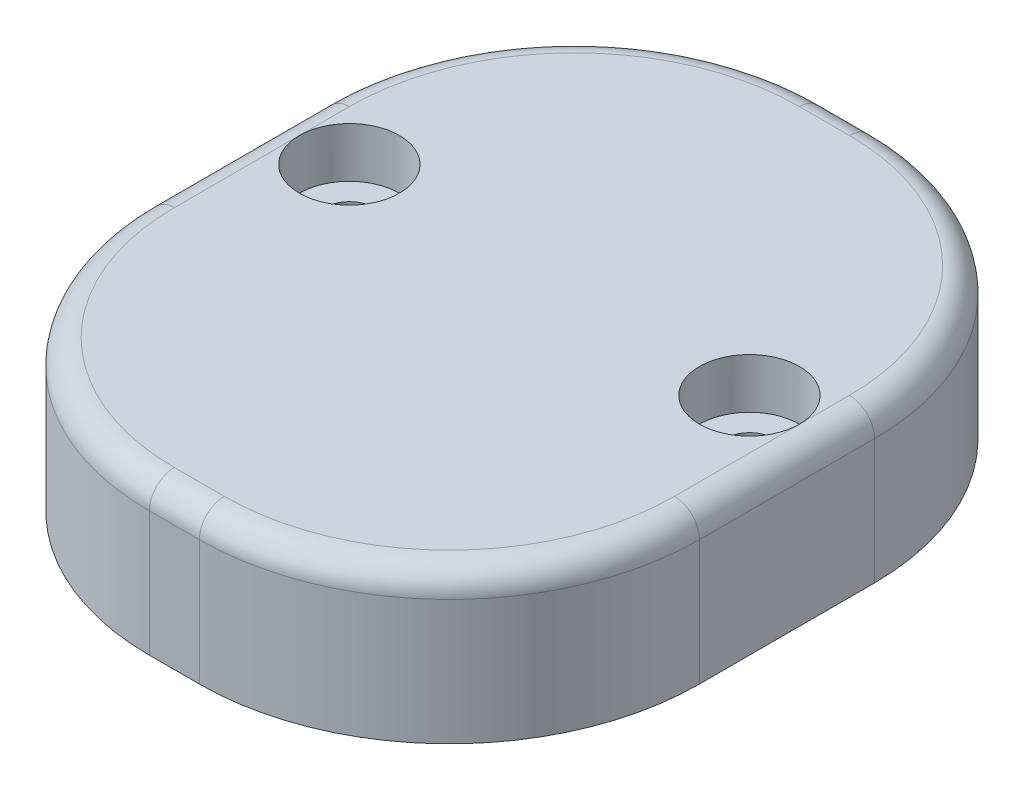
ISO-10303-21;
HEADER;
FILE_DESCRIPTION(('STEP AP214'),'2;1');
FILE_NAME('part.step','',(''),(''),'','','');
FILE_SCHEMA(('AUTOMOTIVE_DESIGN { 1 0 10303 214 1 1 1 1 }'));
ENDSEC;
DATA;
#1=APPLICATION_CONTEXT('core data for automotive mechanical design processes');
#2=APPLICATION_PROTOCOL_DEFINITION('international standard','automotive_design',2000,#1);
#3=PRODUCT_CONTEXT('',#1,'mechanical');
#4=PRODUCT('Part','Part','',(#3));
#5=PRODUCT_RELATED_PRODUCT_CATEGORY('part','',(#4));
#6=PRODUCT_DEFINITION_FORMATION('','',#4);
#7=PRODUCT_DEFINITION_CONTEXT('part definition',#1,'design');
#8=PRODUCT_DEFINITION('design','',#6,#7);
#9=PRODUCT_DEFINITION_SHAPE('','',#8);
#10=(LENGTH_UNIT() NAMED_UNIT(*) SI_UNIT(.MILLI.,.METRE.));
#11=(NAMED_UNIT(*) PLANE_ANGLE_UNIT() SI_UNIT($,.RADIAN.));
#12=(NAMED_UNIT(*) SI_UNIT($,.STERADIAN.) SOLID_ANGLE_UNIT());
#13=UNCERTAINTY_MEASURE_WITH_UNIT(LENGTH_MEASURE(1.E-05),#10,'distance_accuracy_value','');
#14=(GEOMETRIC_REPRESENTATION_CONTEXT(3) GLOBAL_UNCERTAINTY_ASSIGNED_CONTEXT((#13)) GLOBAL_UNIT_ASSIGNED_CONTEXT((#10,
#11,#12)) REPRESENTATION_CONTEXT('',''));
#15=CARTESIAN_POINT('',(0.,0.,0.));
#16=DIRECTION('',(0.,0.,1.));
#17=DIRECTION('',(1.,0.,0.));
#18=AXIS2_PLACEMENT_3D('',#15,#16,#17);
#19=CARTESIAN_POINT('',(0.,0.,0.));
#20=DIRECTION('',(0.,0.,1.));
#21=DIRECTION('',(1.,0.,0.));
#22=AXIS2_PLACEMENT_3D('',#19,#20,#21);
#23=PLANE('',#22);
#24=DIRECTION('',(0.,1.,0.));
#25=VECTOR('',#24,1.);
#26=CARTESIAN_POINT('',(10.,6.,0.));
#27=LINE('',#26,#25);
#28=CARTESIAN_POINT('',(10.,4.89897948556636,0.));
#29=VERTEX_POINT('',#28);
#30=CARTESIAN_POINT('',(10.,5.,0.));
#31=VERTEX_POINT('',#30);
#32=EDGE_CURVE('E187',#29,#31,#27,.T.);
#33=ORIENTED_EDGE('',*,*,#32,.T.);
#34=DIRECTION('',(1.,0.,0.));
#35=VECTOR('',#34,1.);
#36=CARTESIAN_POINT('',(12.,5.,0.));
#37=LINE('',#36,#35);
#38=CARTESIAN_POINT('',(11.,5.,0.));
#39=VERTEX_POINT('',#38);
#40=EDGE_CURVE('E267',#31,#39,#37,.T.);
#41=ORIENTED_EDGE('',*,*,#40,.T.);
#42=CARTESIAN_POINT('',(11.,0.,0.));
#43=DIRECTION('',(0.,0.,1.));
#44=DIRECTION('',(1.,0.,0.));
#45=AXIS2_PLACEMENT_3D('',#42,#43,#44);
#46=CIRCLE('',#45,5.);
#47=EDGE_CURVE('E164',#29,#39,#46,.F.);
#48=ORIENTED_EDGE('',*,*,#47,.F.);
#49=EDGE_LOOP('',(#33,#41,#48));
#50=FACE_BOUND('',#49,.T.);
#51=ADVANCED_FACE('F35',(#50),#23,.F.);
#52=CARTESIAN_POINT('',(11.,0.,22.));
#53=DIRECTION('',(0.,0.,-1.));
#54=DIRECTION('',(-1.,0.,0.));
#55=AXIS2_PLACEMENT_3D('',#52,#53,#54);
#56=CYLINDRICAL_SURFACE('',#55,5.);
#57=DIRECTION('',(0.,0.,-1.));
#58=VECTOR('',#57,1.);
#59=CARTESIAN_POINT('',(6.,0.,22.));
#60=LINE('',#59,#58);
#61=CARTESIAN_POINT('',(6.,0.,22.));
#62=VERTEX_POINT('',#61);
#63=CARTESIAN_POINT('',(6.,0.,0.834848610088321));
#64=VERTEX_POINT('',#63);
#65=EDGE_CURVE('E156',#62,#64,#60,.T.);
#66=ORIENTED_EDGE('',*,*,#65,.T.);
#67=CARTESIAN_POINT('',(6.,0.,0.834848610088321));
#68=CARTESIAN_POINT('',(5.99997867187738,0.135011845033446,0.834882018948806));
#69=CARTESIAN_POINT('',(6.00546746244243,0.270010557183533,0.832463030257463));
#70=CARTESIAN_POINT('',(6.0273036116272,0.538906984847514,0.82296657021474));
#71=CARTESIAN_POINT('',(6.04364641369319,0.672805138510441,0.815891053702076));
#72=CARTESIAN_POINT('',(6.08694176524044,0.93800536106932,0.79736486598689));
#73=CARTESIAN_POINT('',(6.11385130062064,1.06931571634541,0.785931938020787));
#74=CARTESIAN_POINT('',(6.17799889048549,1.32898103097825,0.759138461814082));
#75=CARTESIAN_POINT('',(6.21523768152985,1.45733577886905,0.743777633488427));
#76=CARTESIAN_POINT('',(6.2996412162674,1.71007289707297,0.709714282724713));
#77=CARTESIAN_POINT('',(6.34679151482346,1.83446074821384,0.691016629336118));
#78=CARTESIAN_POINT('',(6.45066344419621,2.07874315416516,0.650919566211288));
#79=CARTESIAN_POINT('',(6.50738867032313,2.19863600039304,0.629519142368764));
#80=CARTESIAN_POINT('',(6.69138039763596,2.55065991663144,0.562302920265389));
#81=CARTESIAN_POINT('',(6.83246766867098,2.77515039770592,0.513470148602644));
#82=CARTESIAN_POINT('',(7.1564694231924,3.21008706511323,0.411226797712404));
#83=CARTESIAN_POINT('',(7.34120934875028,3.41915137620118,0.357710877119809));
#84=CARTESIAN_POINT('',(7.64283316769946,3.70794894262942,0.281225043641196));
#85=CARTESIAN_POINT('',(7.74755685338337,3.80014759496294,0.256342104162777));
#86=CARTESIAN_POINT('',(7.96462514598613,3.97567035613554,0.208699057654279));
#87=CARTESIAN_POINT('',(8.07696676447299,4.05899791241655,0.185938126410237));
#88=CARTESIAN_POINT('',(8.31112881266445,4.21786973870763,0.142911601921965));
#89=CARTESIAN_POINT('',(8.43310154925899,4.29320706490404,0.122710511282571));
#90=CARTESIAN_POINT('',(8.68347126805493,4.43331222756631,0.0862347494353322));
#91=CARTESIAN_POINT('',(8.81186521516233,4.49808499699451,0.0699582439928226));
#92=CARTESIAN_POINT('',(9.07387178505899,4.61634532323629,0.0421084282489397));
#93=CARTESIAN_POINT('',(9.20747142306811,4.66985906491516,0.0305241459201425));
#94=CARTESIAN_POINT('',(9.47903775417308,4.76522326674506,0.0126539151737671));
#95=CARTESIAN_POINT('',(9.61700084044304,4.80708309321236,0.0063637036076295));
#96=CARTESIAN_POINT('',(9.79687154728861,4.85326917813204,0.00198147055236757));
#97=CARTESIAN_POINT('',(9.83735341458672,4.86312562393378,0.00124020583946215));
#98=CARTESIAN_POINT('',(9.91852063678993,4.88181658890864,0.000249786474286768));
#99=CARTESIAN_POINT('',(9.95920577997313,4.89065200450769,1.97011901891483E-07));
#100=CARTESIAN_POINT('',(10.,4.89897948556636,0.));
#101=B_SPLINE_CURVE_WITH_KNOTS('',3,(#67,#68,#69,#70,#71,#72,#73,#74,#75,#76,#77,#78,#79,#80,
#81,#82,#83,#84,#85,#86,#87,#88,#89,#90,#91,#92,#93,#94,#95,#96,#97,#98,#99,#100),.UNSPECIFIED.,
.F.,.F.,(4,2,2,2,2,2,2,2,2,2,2,2,2,2,2,2,4),(0.,0.404881690591231,0.809593517715284,
1.21267468031032,1.6157845932544,2.01831103288909,2.42098895565289,3.22630049164659,
4.07444094444146,4.49921419060271,4.92382175621481,5.35759888778723,5.79117289011644,
6.22372711209933,6.65593267760133,6.78093528552342,6.90582729841),.UNSPECIFIED.);
#102=EDGE_CURVE('E209',#64,#29,#101,.T.);
#103=ORIENTED_EDGE('',*,*,#102,.T.);
#104=ORIENTED_EDGE('',*,*,#47,.T.);
#105=CARTESIAN_POINT('',(12.,4.89897948556636,0.));
#106=VERTEX_POINT('',#105);
#107=EDGE_CURVE('E172',#39,#106,#46,.F.);
#108=ORIENTED_EDGE('',*,*,#107,.T.);
#109=CARTESIAN_POINT('',(12.,4.89897948556636,0.));
#110=CARTESIAN_POINT('',(12.1322032583834,4.87201440791222,-2.14329301021152E-05));
#111=CARTESIAN_POINT('',(12.2632817786647,4.83966390255237,0.0026210772666264));
#112=CARTESIAN_POINT('',(12.5221637065431,4.76456920101274,0.012807986322809));
#113=CARTESIAN_POINT('',(12.6499687294982,4.72183024482699,0.0203499170843514));
#114=CARTESIAN_POINT('',(12.9009022287471,4.62650199462219,0.039870763241075));
#115=CARTESIAN_POINT('',(13.0240475964267,4.57395342911886,0.0518315261982716));
#116=CARTESIAN_POINT('',(13.265360329098,4.45937262791172,0.0796352779055718));
#117=CARTESIAN_POINT('',(13.3835272001646,4.39733945403671,0.0954786507980635));
#118=CARTESIAN_POINT('',(13.7290562348091,4.19794694565129,0.147872954381521));
#119=CARTESIAN_POINT('',(13.9480606298654,4.04705970582392,0.189340943626381));
#120=CARTESIAN_POINT('',(14.3586104835474,3.71347505726727,0.279847902943476));
#121=CARTESIAN_POINT('',(14.550127808398,3.53074547451764,0.328894524855925));
#122=CARTESIAN_POINT('',(14.9118890352833,3.12647082880639,0.431394504019483));
#123=CARTESIAN_POINT('',(15.0803032775626,2.90330913059372,0.484939834020765));
#124=CARTESIAN_POINT('',(15.3782195431659,2.43086293163413,0.586576785252228));
#125=CARTESIAN_POINT('',(15.5077030843076,2.1815660988498,0.634665809400884));
#126=CARTESIAN_POINT('',(15.6705504775165,1.79065148045435,0.697823053148833));
#127=CARTESIAN_POINT('',(15.719898856655,1.65623845449805,0.717513784014776));
#128=CARTESIAN_POINT('',(15.8069961070902,1.38321419059191,0.752892259267276));
#129=CARTESIAN_POINT('',(15.8447503790763,1.24460494045593,0.768581866851002));
#130=CARTESIAN_POINT('',(15.908180059381,0.964546007225919,0.795256124157805));
#131=CARTESIAN_POINT('',(15.9338823337092,0.823103381836048,0.806251233791758));
#132=CARTESIAN_POINT('',(15.9730136005027,0.538297729866727,0.823092907288587));
#133=CARTESIAN_POINT('',(15.9864520818861,0.394936275251337,0.828943451550562));
#134=CARTESIAN_POINT('',(15.9957891902516,0.209406770232198,0.833011982947895));
#135=CARTESIAN_POINT('',(15.9973688350891,0.167521864295987,0.833700727781765));
#136=CARTESIAN_POINT('',(15.9994735454067,0.0837597007614819,0.834618717628923));
#137=CARTESIAN_POINT('',(15.9999995950335,0.0418824725949628,0.834848391452833));
#138=CARTESIAN_POINT('',(16.,0.,0.834848610088265));
#139=B_SPLINE_CURVE_WITH_KNOTS('',3,(#109,#110,#111,#112,#113,#114,#115,#116,#117,#118,#119,
#120,#121,#122,#123,#124,#125,#126,#127,#128,#129,#130,#131,#132,#133,#134,#135,#136,#137,#138),
.UNSPECIFIED.,.F.,.F.,(4,2,2,2,2,2,2,2,2,2,2,2,2,2,4),(0.,0.404599235286033,0.80899481037096,
1.21174728420965,1.61453962216218,2.41817085710597,3.22261885287953,4.07282394175045,
4.92343202678592,5.35655012939949,5.78946617273127,6.22141252807982,6.65302438762456,
6.7787749103284,6.90440791655807),.UNSPECIFIED.);
#140=CARTESIAN_POINT('',(16.,0.,0.834848610088321));
#141=VERTEX_POINT('',#140);
#142=EDGE_CURVE('E152',#106,#141,#139,.T.);
#143=ORIENTED_EDGE('',*,*,#142,.T.);
#144=DIRECTION('',(0.,0.,-1.));
#145=VECTOR('',#144,1.);
#146=CARTESIAN_POINT('',(16.,0.,22.));
#147=LINE('',#146,#145);
#148=CARTESIAN_POINT('',(16.,0.,22.));
#149=VERTEX_POINT('',#148);
#150=EDGE_CURVE('E145',#149,#141,#147,.T.);
#151=ORIENTED_EDGE('',*,*,#150,.F.);
#152=CARTESIAN_POINT('',(11.,0.,22.));
#153=DIRECTION('',(0.,0.,1.));
#154=DIRECTION('',(1.,0.,0.));
#155=AXIS2_PLACEMENT_3D('',#152,#153,#154);
#156=CIRCLE('',#155,5.);
#157=EDGE_CURVE('E149',#62,#149,#156,.F.);
#158=ORIENTED_EDGE('',*,*,#157,.F.);
#159=EDGE_LOOP('',(#66,#103,#104,#108,#143,#151,#158));
#160=FACE_BOUND('',#159,.T.);
#161=ADVANCED_FACE('F148',(#160),#56,.F.);
#162=CARTESIAN_POINT('',(0.,0.,22.));
#163=DIRECTION('',(0.,1.,0.));
#164=DIRECTION('',(0.,0.,1.));
#165=AXIS2_PLACEMENT_3D('',#162,#163,#164);
#166=PLANE('',#165);
#167=CARTESIAN_POINT('',(19.,0.,12.));
#168=DIRECTION('',(0.,1.,0.));
#169=DIRECTION('',(0.,0.,1.));
#170=AXIS2_PLACEMENT_3D('',#167,#168,#169);
#171=CIRCLE('',#170,0.999999999999997);
#172=CARTESIAN_POINT('',(19.,0.,13.));
#173=VERTEX_POINT('',#172);
#174=EDGE_CURVE('E322',#173,#173,#171,.T.);
#175=ORIENTED_EDGE('',*,*,#174,.T.);
#176=EDGE_LOOP('',(#175));
#177=FACE_BOUND('',#176,.T.);
#178=CARTESIAN_POINT('',(3.,0.,12.));
#179=DIRECTION('',(0.,1.,0.));
#180=DIRECTION('',(0.,0.,1.));
#181=AXIS2_PLACEMENT_3D('',#178,#179,#180);
#182=CIRCLE('',#181,0.999999999999998);
#183=CARTESIAN_POINT('',(3.,0.,13.));
#184=VERTEX_POINT('',#183);
#185=EDGE_CURVE('E169',#184,#184,#182,.T.);
#186=ORIENTED_EDGE('',*,*,#185,.T.);
#187=EDGE_LOOP('',(#186));
#188=FACE_BOUND('',#187,.T.);
#189=DIRECTION('',(0.,0.,-1.));
#190=VECTOR('',#189,1.);
#191=CARTESIAN_POINT('',(0.,0.,22.));
#192=LINE('',#191,#190);
#193=CARTESIAN_POINT('',(0.,0.,17.));
#194=VERTEX_POINT('',#193);
#195=CARTESIAN_POINT('',(0.,0.,10.));
#196=VERTEX_POINT('',#195);
#197=EDGE_CURVE('E163',#194,#196,#192,.T.);
#198=ORIENTED_EDGE('',*,*,#197,.T.);
#199=CARTESIAN_POINT('',(10.,0.,10.));
#200=DIRECTION('',(0.,1.,0.));
#201=DIRECTION('',(0.,0.,1.));
#202=AXIS2_PLACEMENT_3D('',#199,#200,#201);
#203=CIRCLE('',#202,10.);
#204=EDGE_CURVE('E201',#196,#64,#203,.F.);
#205=ORIENTED_EDGE('',*,*,#204,.T.);
#206=ORIENTED_EDGE('',*,*,#65,.F.);
#207=DIRECTION('',(1.,0.,0.));
#208=VECTOR('',#207,1.);
#209=CARTESIAN_POINT('',(0.,0.,22.));
#210=LINE('',#209,#208);
#211=EDGE_CURVE('E162',#62,#149,#210,.T.);
#212=ORIENTED_EDGE('',*,*,#211,.T.);
#213=ORIENTED_EDGE('',*,*,#150,.T.);
#214=CARTESIAN_POINT('',(12.,0.,10.));
#215=DIRECTION('',(0.,1.,0.));
#216=DIRECTION('',(0.,0.,1.));
#217=AXIS2_PLACEMENT_3D('',#214,#215,#216);
#218=CIRCLE('',#217,10.);
#219=CARTESIAN_POINT('',(22.,0.,10.));
#220=VERTEX_POINT('',#219);
#221=EDGE_CURVE('E197',#141,#220,#218,.F.);
#222=ORIENTED_EDGE('',*,*,#221,.T.);
#223=DIRECTION('',(0.,0.,-1.));
#224=VECTOR('',#223,1.);
#225=CARTESIAN_POINT('',(22.,0.,22.));
#226=LINE('',#225,#224);
#227=CARTESIAN_POINT('',(22.,0.,17.));
#228=VERTEX_POINT('',#227);
#229=EDGE_CURVE('E157',#228,#220,#226,.T.);
#230=ORIENTED_EDGE('',*,*,#229,.F.);
#231=CARTESIAN_POINT('',(12.,0.,17.));
#232=DIRECTION('',(0.,1.,0.));
#233=DIRECTION('',(0.,0.,1.));
#234=AXIS2_PLACEMENT_3D('',#231,#232,#233);
#235=CIRCLE('',#234,10.);
#236=CARTESIAN_POINT('',(12.,0.,27.));
#237=VERTEX_POINT('',#236);
#238=EDGE_CURVE('E195',#228,#237,#235,.F.);
#239=ORIENTED_EDGE('',*,*,#238,.T.);
#240=DIRECTION('',(1.,0.,0.));
#241=VECTOR('',#240,1.);
#242=CARTESIAN_POINT('',(0.,0.,27.));
#243=LINE('',#242,#241);
#244=CARTESIAN_POINT('',(10.,0.,27.));
#245=VERTEX_POINT('',#244);
#246=EDGE_CURVE('E168',#245,#237,#243,.T.);
#247=ORIENTED_EDGE('',*,*,#246,.F.);
#248=CARTESIAN_POINT('',(10.,0.,17.));
#249=DIRECTION('',(0.,1.,0.));
#250=DIRECTION('',(0.,0.,1.));
#251=AXIS2_PLACEMENT_3D('',#248,#249,#250);
#252=CIRCLE('',#251,10.);
#253=EDGE_CURVE('E199',#245,#194,#252,.F.);
#254=ORIENTED_EDGE('',*,*,#253,.T.);
#255=EDGE_LOOP('',(#198,#205,#206,#212,#213,#222,#230,#239,#247,#254));
#256=FACE_BOUND('',#255,.T.);
#257=ADVANCED_FACE('F167',(#177,#188,#256),#166,.F.);
#258=CARTESIAN_POINT('',(22.,0.,22.));
#259=DIRECTION('',(-1.,0.,0.));
#260=DIRECTION('',(0.,0.,1.));
#261=AXIS2_PLACEMENT_3D('',#258,#259,#260);
#262=PLANE('',#261);
#263=DIRECTION('',(0.,1.,0.));
#264=VECTOR('',#263,1.);
#265=CARTESIAN_POINT('',(22.,0.,10.));
#266=LINE('',#265,#264);
#267=CARTESIAN_POINT('',(22.,5.,10.));
#268=VERTEX_POINT('',#267);
#269=EDGE_CURVE('E380',#220,#268,#266,.T.);
#270=ORIENTED_EDGE('',*,*,#269,.T.);
#271=DIRECTION('',(0.,0.,-1.));
#272=VECTOR('',#271,1.);
#273=CARTESIAN_POINT('',(22.,5.,17.));
#274=LINE('',#273,#272);
#275=CARTESIAN_POINT('',(22.,5.,17.));
#276=VERTEX_POINT('',#275);
#277=EDGE_CURVE('E276',#268,#276,#274,.F.);
#278=ORIENTED_EDGE('',*,*,#277,.T.);
#279=DIRECTION('',(0.,1.,0.));
#280=VECTOR('',#279,1.);
#281=CARTESIAN_POINT('',(22.,0.,17.));
#282=LINE('',#281,#280);
#283=EDGE_CURVE('E377',#276,#228,#282,.F.);
#284=ORIENTED_EDGE('',*,*,#283,.T.);
#285=ORIENTED_EDGE('',*,*,#229,.T.);
#286=EDGE_LOOP('',(#270,#278,#284,#285));
#287=FACE_BOUND('',#286,.T.);
#288=ADVANCED_FACE('F376',(#287),#262,.F.);
#289=CARTESIAN_POINT('',(0.,6.,22.));
#290=DIRECTION('',(0.,1.,0.));
#291=DIRECTION('',(0.,0.,1.));
#292=AXIS2_PLACEMENT_3D('',#289,#290,#291);
#293=PLANE('',#292);
#294=CARTESIAN_POINT('',(12.,6.,17.));
#295=DIRECTION('',(0.,1.,0.));
#296=DIRECTION('',(0.,0.,1.));
#297=AXIS2_PLACEMENT_3D('',#294,#295,#296);
#298=CIRCLE('',#297,9.);
#299=CARTESIAN_POINT('',(12.,6.,26.));
#300=VERTEX_POINT('',#299);
#301=CARTESIAN_POINT('',(21.,6.,17.));
#302=VERTEX_POINT('',#301);
#303=EDGE_CURVE('E386',#300,#302,#298,.T.);
#304=ORIENTED_EDGE('',*,*,#303,.T.);
#305=DIRECTION('',(0.,0.,-1.));
#306=VECTOR('',#305,1.);
#307=CARTESIAN_POINT('',(21.,6.,10.));
#308=LINE('',#307,#306);
#309=CARTESIAN_POINT('',(21.,6.,12.));
#310=VERTEX_POINT('',#309);
#311=EDGE_CURVE('E370',#302,#310,#308,.T.);
#312=ORIENTED_EDGE('',*,*,#311,.T.);
#313=CARTESIAN_POINT('',(19.,6.,12.));
#314=DIRECTION('',(0.,1.,0.));
#315=DIRECTION('',(0.,0.,1.));
#316=AXIS2_PLACEMENT_3D('',#313,#314,#315);
#317=CIRCLE('',#316,2.);
#318=EDGE_CURVE('E306',#310,#310,#317,.T.);
#319=ORIENTED_EDGE('',*,*,#318,.F.);
#320=DIRECTION('',(0.,0.,-1.));
#321=VECTOR('',#320,1.);
#322=CARTESIAN_POINT('',(21.,6.,10.));
#323=LINE('',#322,#321);
#324=CARTESIAN_POINT('',(21.,6.,10.));
#325=VERTEX_POINT('',#324);
#326=EDGE_CURVE('E368',#310,#325,#323,.T.);
#327=ORIENTED_EDGE('',*,*,#326,.T.);
#328=CARTESIAN_POINT('',(12.,6.,10.));
#329=DIRECTION('',(0.,1.,0.));
#330=DIRECTION('',(0.,0.,1.));
#331=AXIS2_PLACEMENT_3D('',#328,#329,#330);
#332=CIRCLE('',#331,9.);
#333=CARTESIAN_POINT('',(12.,6.,1.));
#334=VERTEX_POINT('',#333);
#335=EDGE_CURVE('E366',#325,#334,#332,.T.);
#336=ORIENTED_EDGE('',*,*,#335,.T.);
#337=DIRECTION('',(1.,0.,0.));
#338=VECTOR('',#337,1.);
#339=CARTESIAN_POINT('',(10.,6.,1.));
#340=LINE('',#339,#338);
#341=CARTESIAN_POINT('',(10.,6.,1.));
#342=VERTEX_POINT('',#341);
#343=EDGE_CURVE('E364',#334,#342,#340,.F.);
#344=ORIENTED_EDGE('',*,*,#343,.T.);
#345=CARTESIAN_POINT('',(10.,6.,10.));
#346=DIRECTION('',(0.,1.,0.));
#347=DIRECTION('',(0.,0.,1.));
#348=AXIS2_PLACEMENT_3D('',#345,#346,#347);
#349=CIRCLE('',#348,9.);
#350=CARTESIAN_POINT('',(1.,6.,10.));
#351=VERTEX_POINT('',#350);
#352=EDGE_CURVE('E357',#342,#351,#349,.T.);
#353=ORIENTED_EDGE('',*,*,#352,.T.);
#354=DIRECTION('',(0.,0.,-1.));
#355=VECTOR('',#354,1.);
#356=CARTESIAN_POINT('',(1.,6.,22.));
#357=LINE('',#356,#355);
#358=CARTESIAN_POINT('',(1.,6.,12.));
#359=VERTEX_POINT('',#358);
#360=EDGE_CURVE('E352',#351,#359,#357,.F.);
#361=ORIENTED_EDGE('',*,*,#360,.T.);
#362=CARTESIAN_POINT('',(3.,6.,12.));
#363=DIRECTION('',(0.,1.,0.));
#364=DIRECTION('',(0.,0.,1.));
#365=AXIS2_PLACEMENT_3D('',#362,#363,#364);
#366=CIRCLE('',#365,2.);
#367=EDGE_CURVE('E325',#359,#359,#366,.T.);
#368=ORIENTED_EDGE('',*,*,#367,.F.);
#369=DIRECTION('',(0.,0.,-1.));
#370=VECTOR('',#369,1.);
#371=CARTESIAN_POINT('',(1.,6.,22.));
#372=LINE('',#371,#370);
#373=CARTESIAN_POINT('',(1.,6.,17.));
#374=VERTEX_POINT('',#373);
#375=EDGE_CURVE('E350',#359,#374,#372,.F.);
#376=ORIENTED_EDGE('',*,*,#375,.T.);
#377=CARTESIAN_POINT('',(10.,6.,17.));
#378=DIRECTION('',(0.,1.,0.));
#379=DIRECTION('',(0.,0.,1.));
#380=AXIS2_PLACEMENT_3D('',#377,#378,#379);
#381=CIRCLE('',#380,9.);
#382=CARTESIAN_POINT('',(10.,6.,26.));
#383=VERTEX_POINT('',#382);
#384=EDGE_CURVE('E355',#374,#383,#381,.T.);
#385=ORIENTED_EDGE('',*,*,#384,.T.);
#386=DIRECTION('',(-1.,0.,0.));
#387=VECTOR('',#386,1.);
#388=CARTESIAN_POINT('',(12.,6.,26.));
#389=LINE('',#388,#387);
#390=EDGE_CURVE('E359',#383,#300,#389,.F.);
#391=ORIENTED_EDGE('',*,*,#390,.T.);
#392=EDGE_LOOP('',(#304,#312,#319,#327,#336,#344,#353,#361,#368,#376,#385,#391));
#393=FACE_BOUND('',#392,.T.);
#394=ADVANCED_FACE('F253',(#393),#293,.T.);
#395=CARTESIAN_POINT('',(0.,0.,22.));
#396=DIRECTION('',(-1.,0.,0.));
#397=DIRECTION('',(0.,0.,1.));
#398=AXIS2_PLACEMENT_3D('',#395,#396,#397);
#399=PLANE('',#398);
#400=DIRECTION('',(0.,-1.,0.));
#401=VECTOR('',#400,1.);
#402=CARTESIAN_POINT('',(0.,6.,17.));
#403=LINE('',#402,#401);
#404=CARTESIAN_POINT('',(0.,5.,17.));
#405=VERTEX_POINT('',#404);
#406=EDGE_CURVE('E190',#194,#405,#403,.F.);
#407=ORIENTED_EDGE('',*,*,#406,.T.);
#408=DIRECTION('',(0.,0.,-1.));
#409=VECTOR('',#408,1.);
#410=CARTESIAN_POINT('',(0.,5.,22.));
#411=LINE('',#410,#409);
#412=CARTESIAN_POINT('',(0.,5.,10.));
#413=VERTEX_POINT('',#412);
#414=EDGE_CURVE('E281',#405,#413,#411,.T.);
#415=ORIENTED_EDGE('',*,*,#414,.T.);
#416=DIRECTION('',(0.,1.,0.));
#417=VECTOR('',#416,1.);
#418=CARTESIAN_POINT('',(0.,0.,10.));
#419=LINE('',#418,#417);
#420=EDGE_CURVE('E193',#413,#196,#419,.F.);
#421=ORIENTED_EDGE('',*,*,#420,.T.);
#422=ORIENTED_EDGE('',*,*,#197,.F.);
#423=EDGE_LOOP('',(#407,#415,#421,#422));
#424=FACE_BOUND('',#423,.T.);
#425=ADVANCED_FACE('F246',(#424),#399,.T.);
#426=ORIENTED_EDGE('',*,*,#107,.F.);
#427=DIRECTION('',(1.,0.,0.));
#428=VECTOR('',#427,1.);
#429=CARTESIAN_POINT('',(12.,5.,0.));
#430=LINE('',#429,#428);
#431=CARTESIAN_POINT('',(12.,5.,0.));
#432=VERTEX_POINT('',#431);
#433=EDGE_CURVE('E257',#39,#432,#430,.T.);
#434=ORIENTED_EDGE('',*,*,#433,.T.);
#435=DIRECTION('',(0.,1.,0.));
#436=VECTOR('',#435,1.);
#437=CARTESIAN_POINT('',(12.,0.,0.));
#438=LINE('',#437,#436);
#439=EDGE_CURVE('E184',#432,#106,#438,.F.);
#440=ORIENTED_EDGE('',*,*,#439,.T.);
#441=EDGE_LOOP('',(#426,#434,#440));
#442=FACE_BOUND('',#441,.T.);
#443=ADVANCED_FACE('F240',(#442),#23,.F.);
#444=CARTESIAN_POINT('',(0.,0.,22.));
#445=DIRECTION('',(0.,0.,-1.));
#446=DIRECTION('',(-1.,0.,0.));
#447=AXIS2_PLACEMENT_3D('',#444,#445,#446);
#448=PLANE('',#447);
#449=ORIENTED_EDGE('',*,*,#211,.F.);
#450=ORIENTED_EDGE('',*,*,#157,.T.);
#451=EDGE_LOOP('',(#449,#450));
#452=FACE_BOUND('',#451,.T.);
#453=ADVANCED_FACE('F161',(#452),#448,.T.);
#454=CARTESIAN_POINT('',(0.,0.,27.));
#455=DIRECTION('',(0.,0.,-1.));
#456=DIRECTION('',(-1.,0.,0.));
#457=AXIS2_PLACEMENT_3D('',#454,#455,#456);
#458=PLANE('',#457);
#459=DIRECTION('',(0.,1.,0.));
#460=VECTOR('',#459,1.);
#461=CARTESIAN_POINT('',(12.,0.,27.));
#462=LINE('',#461,#460);
#463=CARTESIAN_POINT('',(12.,5.,27.));
#464=VERTEX_POINT('',#463);
#465=EDGE_CURVE('E388',#237,#464,#462,.T.);
#466=ORIENTED_EDGE('',*,*,#465,.T.);
#467=DIRECTION('',(-1.,0.,0.));
#468=VECTOR('',#467,1.);
#469=CARTESIAN_POINT('',(10.,5.,27.));
#470=LINE('',#469,#468);
#471=CARTESIAN_POINT('',(10.,5.,27.));
#472=VERTEX_POINT('',#471);
#473=EDGE_CURVE('E44',#464,#472,#470,.T.);
#474=ORIENTED_EDGE('',*,*,#473,.T.);
#475=DIRECTION('',(0.,-1.,0.));
#476=VECTOR('',#475,1.);
#477=CARTESIAN_POINT('',(10.,0.,27.));
#478=LINE('',#477,#476);
#479=EDGE_CURVE('E384',#472,#245,#478,.T.);
#480=ORIENTED_EDGE('',*,*,#479,.T.);
#481=ORIENTED_EDGE('',*,*,#246,.T.);
#482=EDGE_LOOP('',(#466,#474,#480,#481));
#483=FACE_BOUND('',#482,.T.);
#484=ADVANCED_FACE('F252',(#483),#458,.F.);
#485=CARTESIAN_POINT('',(3.,6.,12.));
#486=DIRECTION('',(0.,1.,0.));
#487=DIRECTION('',(0.,0.,1.));
#488=AXIS2_PLACEMENT_3D('',#485,#486,#487);
#489=CYLINDRICAL_SURFACE('',#488,0.999999999999999);
#490=ORIENTED_EDGE('',*,*,#185,.F.);
#491=EDGE_LOOP('',(#490));
#492=FACE_BOUND('',#491,.T.);
#493=CARTESIAN_POINT('',(3.,4.,12.));
#494=DIRECTION('',(0.,1.,0.));
#495=DIRECTION('',(0.,0.,1.));
#496=AXIS2_PLACEMENT_3D('',#493,#494,#495);
#497=CIRCLE('',#496,1.);
#498=CARTESIAN_POINT('',(3.,4.,13.));
#499=VERTEX_POINT('',#498);
#500=EDGE_CURVE('E175',#499,#499,#497,.T.);
#501=ORIENTED_EDGE('',*,*,#500,.T.);
#502=EDGE_LOOP('',(#501));
#503=FACE_BOUND('',#502,.T.);
#504=ADVANCED_FACE('F334',(#492,#503),#489,.F.);
#505=CARTESIAN_POINT('',(4.,4.,12.));
#506=DIRECTION('',(0.,-1.,0.));
#507=DIRECTION('',(0.,0.,-1.));
#508=AXIS2_PLACEMENT_3D('',#505,#506,#507);
#509=PLANE('',#508);
#510=ORIENTED_EDGE('',*,*,#500,.F.);
#511=EDGE_LOOP('',(#510));
#512=FACE_BOUND('',#511,.T.);
#513=CARTESIAN_POINT('',(3.,4.,12.));
#514=DIRECTION('',(0.,1.,0.));
#515=DIRECTION('',(0.,0.,1.));
#516=AXIS2_PLACEMENT_3D('',#513,#514,#515);
#517=CIRCLE('',#516,2.);
#518=CARTESIAN_POINT('',(3.,4.,14.));
#519=VERTEX_POINT('',#518);
#520=EDGE_CURVE('E328',#519,#519,#517,.T.);
#521=ORIENTED_EDGE('',*,*,#520,.T.);
#522=EDGE_LOOP('',(#521));
#523=FACE_BOUND('',#522,.T.);
#524=ADVANCED_FACE('F336',(#512,#523),#509,.F.);
#525=CARTESIAN_POINT('',(3.,6.,12.));
#526=DIRECTION('',(0.,1.,0.));
#527=DIRECTION('',(0.,0.,1.));
#528=AXIS2_PLACEMENT_3D('',#525,#526,#527);
#529=CYLINDRICAL_SURFACE('',#528,2.);
#530=ORIENTED_EDGE('',*,*,#520,.F.);
#531=EDGE_LOOP('',(#530));
#532=FACE_BOUND('',#531,.T.);
#533=ORIENTED_EDGE('',*,*,#367,.T.);
#534=EDGE_LOOP('',(#533));
#535=FACE_BOUND('',#534,.T.);
#536=ADVANCED_FACE('F339',(#532,#535),#529,.F.);
#537=CARTESIAN_POINT('',(19.,6.,12.));
#538=DIRECTION('',(0.,1.,0.));
#539=DIRECTION('',(0.,0.,1.));
#540=AXIS2_PLACEMENT_3D('',#537,#538,#539);
#541=CYLINDRICAL_SURFACE('',#540,0.999999999999999);
#542=ORIENTED_EDGE('',*,*,#174,.F.);
#543=EDGE_LOOP('',(#542));
#544=FACE_BOUND('',#543,.T.);
#545=CARTESIAN_POINT('',(19.,4.,12.));
#546=DIRECTION('',(0.,1.,0.));
#547=DIRECTION('',(0.,0.,1.));
#548=AXIS2_PLACEMENT_3D('',#545,#546,#547);
#549=CIRCLE('',#548,1.);
#550=CARTESIAN_POINT('',(19.,4.,13.));
#551=VERTEX_POINT('',#550);
#552=EDGE_CURVE('E317',#551,#551,#549,.T.);
#553=ORIENTED_EDGE('',*,*,#552,.T.);
#554=EDGE_LOOP('',(#553));
#555=FACE_BOUND('',#554,.T.);
#556=ADVANCED_FACE('F345',(#544,#555),#541,.F.);
#557=CARTESIAN_POINT('',(20.,4.,12.));
#558=DIRECTION('',(0.,-1.,0.));
#559=DIRECTION('',(0.,0.,-1.));
#560=AXIS2_PLACEMENT_3D('',#557,#558,#559);
#561=PLANE('',#560);
#562=ORIENTED_EDGE('',*,*,#552,.F.);
#563=EDGE_LOOP('',(#562));
#564=FACE_BOUND('',#563,.T.);
#565=CARTESIAN_POINT('',(19.,4.,12.));
#566=DIRECTION('',(0.,1.,0.));
#567=DIRECTION('',(0.,0.,1.));
#568=AXIS2_PLACEMENT_3D('',#565,#566,#567);
#569=CIRCLE('',#568,2.);
#570=CARTESIAN_POINT('',(19.,4.,14.));
#571=VERTEX_POINT('',#570);
#572=EDGE_CURVE('E312',#571,#571,#569,.T.);
#573=ORIENTED_EDGE('',*,*,#572,.T.);
#574=EDGE_LOOP('',(#573));
#575=FACE_BOUND('',#574,.T.);
#576=ADVANCED_FACE('F509',(#564,#575),#561,.F.);
#577=CARTESIAN_POINT('',(19.,6.,12.));
#578=DIRECTION('',(0.,1.,0.));
#579=DIRECTION('',(0.,0.,1.));
#580=AXIS2_PLACEMENT_3D('',#577,#578,#579);
#581=CYLINDRICAL_SURFACE('',#580,2.);
#582=ORIENTED_EDGE('',*,*,#572,.F.);
#583=EDGE_LOOP('',(#582));
#584=FACE_BOUND('',#583,.T.);
#585=ORIENTED_EDGE('',*,*,#318,.T.);
#586=EDGE_LOOP('',(#585));
#587=FACE_BOUND('',#586,.T.);
#588=ADVANCED_FACE('F228',(#584,#587),#581,.F.);
#589=CARTESIAN_POINT('',(10.,0.,10.));
#590=DIRECTION('',(0.,-1.,0.));
#591=DIRECTION('',(0.,0.,-1.));
#592=AXIS2_PLACEMENT_3D('',#589,#590,#591);
#593=CYLINDRICAL_SURFACE('',#592,10.);
#594=ORIENTED_EDGE('',*,*,#420,.F.);
#595=CARTESIAN_POINT('',(10.,5.,10.));
#596=DIRECTION('',(0.,1.,0.));
#597=DIRECTION('',(0.,0.,1.));
#598=AXIS2_PLACEMENT_3D('',#595,#596,#597);
#599=CIRCLE('',#598,10.);
#600=EDGE_CURVE('E274',#413,#31,#599,.F.);
#601=ORIENTED_EDGE('',*,*,#600,.T.);
#602=ORIENTED_EDGE('',*,*,#32,.F.);
#603=ORIENTED_EDGE('',*,*,#102,.F.);
#604=ORIENTED_EDGE('',*,*,#204,.F.);
#605=EDGE_LOOP('',(#594,#601,#602,#603,#604));
#606=FACE_BOUND('',#605,.T.);
#607=ADVANCED_FACE('F223',(#606),#593,.T.);
#608=CARTESIAN_POINT('',(10.,0.,17.));
#609=DIRECTION('',(0.,1.,0.));
#610=DIRECTION('',(0.,0.,1.));
#611=AXIS2_PLACEMENT_3D('',#608,#609,#610);
#612=CYLINDRICAL_SURFACE('',#611,10.);
#613=ORIENTED_EDGE('',*,*,#479,.F.);
#614=CARTESIAN_POINT('',(10.,5.,17.));
#615=DIRECTION('',(0.,1.,0.));
#616=DIRECTION('',(0.,0.,1.));
#617=AXIS2_PLACEMENT_3D('',#614,#615,#616);
#618=CIRCLE('',#617,10.);
#619=EDGE_CURVE('E283',#472,#405,#618,.F.);
#620=ORIENTED_EDGE('',*,*,#619,.T.);
#621=ORIENTED_EDGE('',*,*,#406,.F.);
#622=ORIENTED_EDGE('',*,*,#253,.F.);
#623=EDGE_LOOP('',(#613,#620,#621,#622));
#624=FACE_BOUND('',#623,.T.);
#625=ADVANCED_FACE('F227',(#624),#612,.T.);
#626=CARTESIAN_POINT('',(12.,0.,10.));
#627=DIRECTION('',(0.,1.,0.));
#628=DIRECTION('',(0.,0.,1.));
#629=AXIS2_PLACEMENT_3D('',#626,#627,#628);
#630=CYLINDRICAL_SURFACE('',#629,10.);
#631=ORIENTED_EDGE('',*,*,#439,.F.);
#632=CARTESIAN_POINT('',(12.,5.,10.));
#633=DIRECTION('',(0.,1.,0.));
#634=DIRECTION('',(0.,0.,1.));
#635=AXIS2_PLACEMENT_3D('',#632,#633,#634);
#636=CIRCLE('',#635,10.);
#637=EDGE_CURVE('E272',#432,#268,#636,.F.);
#638=ORIENTED_EDGE('',*,*,#637,.T.);
#639=ORIENTED_EDGE('',*,*,#269,.F.);
#640=ORIENTED_EDGE('',*,*,#221,.F.);
#641=ORIENTED_EDGE('',*,*,#142,.F.);
#642=EDGE_LOOP('',(#631,#638,#639,#640,#641));
#643=FACE_BOUND('',#642,.T.);
#644=ADVANCED_FACE('F215',(#643),#630,.T.);
#645=CARTESIAN_POINT('',(12.,0.,17.));
#646=DIRECTION('',(0.,1.,0.));
#647=DIRECTION('',(0.,0.,1.));
#648=AXIS2_PLACEMENT_3D('',#645,#646,#647);
#649=CYLINDRICAL_SURFACE('',#648,10.);
#650=ORIENTED_EDGE('',*,*,#283,.F.);
#651=CARTESIAN_POINT('',(12.,5.,17.));
#652=DIRECTION('',(0.,1.,0.));
#653=DIRECTION('',(0.,0.,1.));
#654=AXIS2_PLACEMENT_3D('',#651,#652,#653);
#655=CIRCLE('',#654,10.);
#656=EDGE_CURVE('E11',#276,#464,#655,.F.);
#657=ORIENTED_EDGE('',*,*,#656,.T.);
#658=ORIENTED_EDGE('',*,*,#465,.F.);
#659=ORIENTED_EDGE('',*,*,#238,.F.);
#660=EDGE_LOOP('',(#650,#657,#658,#659));
#661=FACE_BOUND('',#660,.T.);
#662=ADVANCED_FACE('F235',(#661),#649,.T.);
#663=CARTESIAN_POINT('',(1.,5.,22.));
#664=DIRECTION('',(0.,0.,-1.));
#665=DIRECTION('',(-1.,0.,0.));
#666=AXIS2_PLACEMENT_3D('',#663,#664,#665);
#667=CYLINDRICAL_SURFACE('',#666,1.);
#668=CARTESIAN_POINT('',(1.,5.,10.));
#669=DIRECTION('',(0.,0.,-1.));
#670=DIRECTION('',(-1.,0.,0.));
#671=AXIS2_PLACEMENT_3D('',#668,#669,#670);
#672=CIRCLE('',#671,1.);
#673=EDGE_CURVE('E299',#413,#351,#672,.T.);
#674=ORIENTED_EDGE('',*,*,#673,.F.);
#675=ORIENTED_EDGE('',*,*,#414,.F.);
#676=CARTESIAN_POINT('',(1.,5.,17.));
#677=DIRECTION('',(0.,0.,1.));
#678=DIRECTION('',(1.,0.,0.));
#679=AXIS2_PLACEMENT_3D('',#676,#677,#678);
#680=CIRCLE('',#679,1.);
#681=EDGE_CURVE('E39',#374,#405,#680,.T.);
#682=ORIENTED_EDGE('',*,*,#681,.F.);
#683=ORIENTED_EDGE('',*,*,#375,.F.);
#684=ORIENTED_EDGE('',*,*,#360,.F.);
#685=EDGE_LOOP('',(#674,#675,#682,#683,#684));
#686=FACE_BOUND('',#685,.T.);
#687=ADVANCED_FACE('F37',(#686),#667,.T.);
#688=CARTESIAN_POINT('',(10.,5.,17.));
#689=DIRECTION('',(0.,1.,0.));
#690=DIRECTION('',(0.,0.,1.));
#691=AXIS2_PLACEMENT_3D('',#688,#689,#690);
#692=TOROIDAL_SURFACE('',#691,9.,1.);
#693=ORIENTED_EDGE('',*,*,#681,.T.);
#694=ORIENTED_EDGE('',*,*,#619,.F.);
#695=CARTESIAN_POINT('',(10.,5.,26.));
#696=DIRECTION('',(1.,0.,0.));
#697=DIRECTION('',(0.,0.,-1.));
#698=AXIS2_PLACEMENT_3D('',#695,#696,#697);
#699=CIRCLE('',#698,1.);
#700=EDGE_CURVE('E297',#383,#472,#699,.T.);
#701=ORIENTED_EDGE('',*,*,#700,.F.);
#702=ORIENTED_EDGE('',*,*,#384,.F.);
#703=EDGE_LOOP('',(#693,#694,#701,#702));
#704=FACE_BOUND('',#703,.T.);
#705=ADVANCED_FACE('F414',(#704),#692,.T.);
#706=CARTESIAN_POINT('',(10.,5.,10.));
#707=DIRECTION('',(0.,1.,0.));
#708=DIRECTION('',(0.,0.,1.));
#709=AXIS2_PLACEMENT_3D('',#706,#707,#708);
#710=TOROIDAL_SURFACE('',#709,9.,1.);
#711=ORIENTED_EDGE('',*,*,#673,.T.);
#712=ORIENTED_EDGE('',*,*,#352,.F.);
#713=CARTESIAN_POINT('',(10.,5.,1.));
#714=DIRECTION('',(1.,0.,0.));
#715=DIRECTION('',(0.,0.,-1.));
#716=AXIS2_PLACEMENT_3D('',#713,#714,#715);
#717=CIRCLE('',#716,1.);
#718=EDGE_CURVE('E295',#31,#342,#717,.T.);
#719=ORIENTED_EDGE('',*,*,#718,.F.);
#720=ORIENTED_EDGE('',*,*,#600,.F.);
#721=EDGE_LOOP('',(#711,#712,#719,#720));
#722=FACE_BOUND('',#721,.T.);
#723=ADVANCED_FACE('F412',(#722),#710,.T.);
#724=CARTESIAN_POINT('',(0.,5.,26.));
#725=DIRECTION('',(1.,0.,0.));
#726=DIRECTION('',(0.,0.,-1.));
#727=AXIS2_PLACEMENT_3D('',#724,#725,#726);
#728=CYLINDRICAL_SURFACE('',#727,1.);
#729=ORIENTED_EDGE('',*,*,#700,.T.);
#730=ORIENTED_EDGE('',*,*,#473,.F.);
#731=CARTESIAN_POINT('',(12.,5.,26.));
#732=DIRECTION('',(1.,0.,0.));
#733=DIRECTION('',(0.,0.,-1.));
#734=AXIS2_PLACEMENT_3D('',#731,#732,#733);
#735=CIRCLE('',#734,1.);
#736=EDGE_CURVE('E292',#300,#464,#735,.T.);
#737=ORIENTED_EDGE('',*,*,#736,.F.);
#738=ORIENTED_EDGE('',*,*,#390,.F.);
#739=EDGE_LOOP('',(#729,#730,#737,#738));
#740=FACE_BOUND('',#739,.T.);
#741=ADVANCED_FACE('F397',(#740),#728,.T.);
#742=CARTESIAN_POINT('',(0.,5.,1.));
#743=DIRECTION('',(-1.,0.,0.));
#744=DIRECTION('',(0.,0.,1.));
#745=AXIS2_PLACEMENT_3D('',#742,#743,#744);
#746=CYLINDRICAL_SURFACE('',#745,1.);
#747=ORIENTED_EDGE('',*,*,#718,.T.);
#748=ORIENTED_EDGE('',*,*,#343,.F.);
#749=CARTESIAN_POINT('',(12.,5.,1.));
#750=DIRECTION('',(1.,0.,0.));
#751=DIRECTION('',(0.,0.,-1.));
#752=AXIS2_PLACEMENT_3D('',#749,#750,#751);
#753=CIRCLE('',#752,1.);
#754=EDGE_CURVE('E270',#432,#334,#753,.T.);
#755=ORIENTED_EDGE('',*,*,#754,.F.);
#756=ORIENTED_EDGE('',*,*,#433,.F.);
#757=ORIENTED_EDGE('',*,*,#40,.F.);
#758=EDGE_LOOP('',(#747,#748,#755,#756,#757));
#759=FACE_BOUND('',#758,.T.);
#760=ADVANCED_FACE('F266',(#759),#746,.T.);
#761=CARTESIAN_POINT('',(12.,5.,17.));
#762=DIRECTION('',(0.,1.,0.));
#763=DIRECTION('',(0.,0.,1.));
#764=AXIS2_PLACEMENT_3D('',#761,#762,#763);
#765=TOROIDAL_SURFACE('',#764,9.,1.);
#766=ORIENTED_EDGE('',*,*,#736,.T.);
#767=ORIENTED_EDGE('',*,*,#656,.F.);
#768=CARTESIAN_POINT('',(21.,5.,17.));
#769=DIRECTION('',(0.,0.,-1.));
#770=DIRECTION('',(-1.,0.,0.));
#771=AXIS2_PLACEMENT_3D('',#768,#769,#770);
#772=CIRCLE('',#771,1.);
#773=EDGE_CURVE('E289',#302,#276,#772,.T.);
#774=ORIENTED_EDGE('',*,*,#773,.F.);
#775=ORIENTED_EDGE('',*,*,#303,.F.);
#776=EDGE_LOOP('',(#766,#767,#774,#775));
#777=FACE_BOUND('',#776,.T.);
#778=ADVANCED_FACE('F399',(#777),#765,.T.);
#779=CARTESIAN_POINT('',(12.,5.,10.));
#780=DIRECTION('',(0.,1.,0.));
#781=DIRECTION('',(0.,0.,1.));
#782=AXIS2_PLACEMENT_3D('',#779,#780,#781);
#783=TOROIDAL_SURFACE('',#782,9.,1.);
#784=ORIENTED_EDGE('',*,*,#754,.T.);
#785=ORIENTED_EDGE('',*,*,#335,.F.);
#786=CARTESIAN_POINT('',(21.,5.,10.));
#787=DIRECTION('',(0.,0.,1.));
#788=DIRECTION('',(1.,0.,0.));
#789=AXIS2_PLACEMENT_3D('',#786,#787,#788);
#790=CIRCLE('',#789,1.);
#791=EDGE_CURVE('E286',#268,#325,#790,.T.);
#792=ORIENTED_EDGE('',*,*,#791,.F.);
#793=ORIENTED_EDGE('',*,*,#637,.F.);
#794=EDGE_LOOP('',(#784,#785,#792,#793));
#795=FACE_BOUND('',#794,.T.);
#796=ADVANCED_FACE('F404',(#795),#783,.T.);
#797=CARTESIAN_POINT('',(21.,5.,22.));
#798=DIRECTION('',(0.,0.,1.));
#799=DIRECTION('',(1.,0.,0.));
#800=AXIS2_PLACEMENT_3D('',#797,#798,#799);
#801=CYLINDRICAL_SURFACE('',#800,1.);
#802=ORIENTED_EDGE('',*,*,#773,.T.);
#803=ORIENTED_EDGE('',*,*,#277,.F.);
#804=ORIENTED_EDGE('',*,*,#791,.T.);
#805=ORIENTED_EDGE('',*,*,#326,.F.);
#806=ORIENTED_EDGE('',*,*,#311,.F.);
#807=EDGE_LOOP('',(#802,#803,#804,#805,#806));
#808=FACE_BOUND('',#807,.T.);
#809=ADVANCED_FACE('F401',(#808),#801,.T.);
#810=CLOSED_SHELL('',(#51,#161,#257,#288,#394,#425,#443,#453,#484,#504,#524,#536,#556,#576,#588,
#607,#625,#644,#662,#687,#705,#723,#741,#760,#778,#796,#809));
#811=MANIFOLD_SOLID_BREP('B2',#810);
#812=ADVANCED_BREP_SHAPE_REPRESENTATION('',(#18,#811),#14);
#813=SHAPE_DEFINITION_REPRESENTATION(#9,#812);
ENDSEC;
END-ISO-10303-21;
